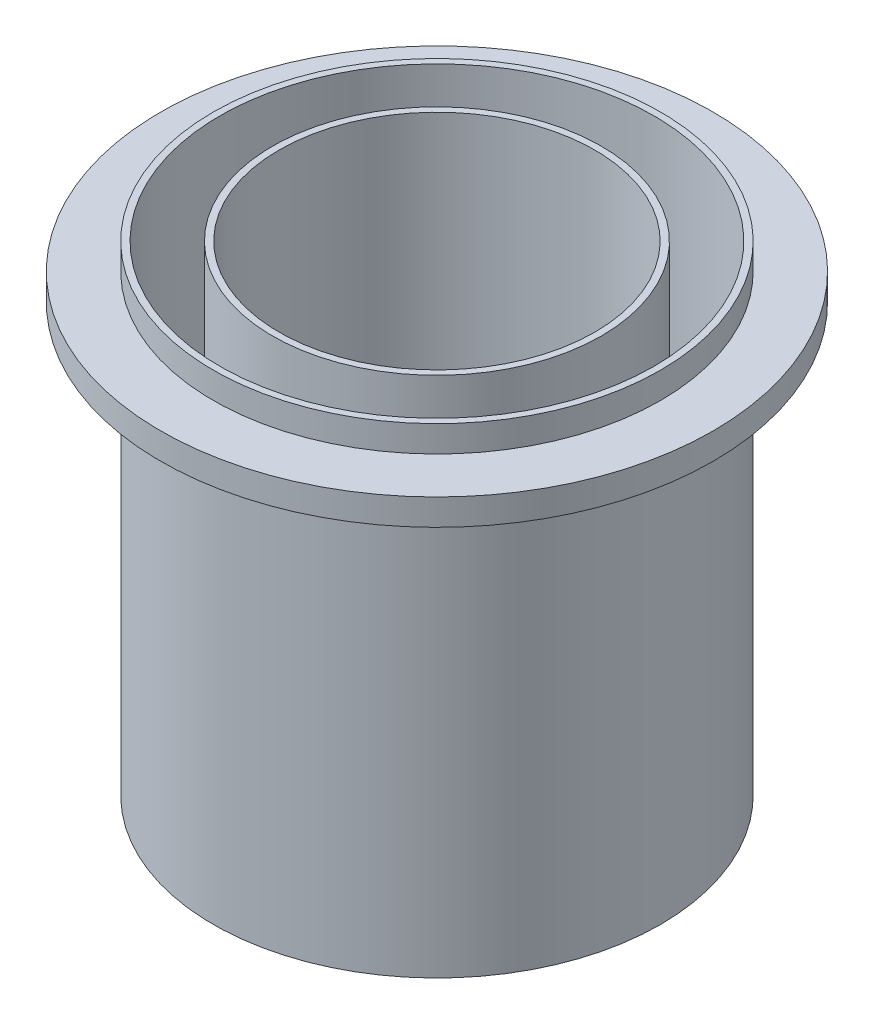
ISO-10303-21;
HEADER;
FILE_DESCRIPTION(('STEP AP214'),'2;1');
FILE_NAME('part.step','',(''),(''),'','','');
FILE_SCHEMA(('AUTOMOTIVE_DESIGN { 1 0 10303 214 1 1 1 1 }'));
ENDSEC;
DATA;
#1=APPLICATION_CONTEXT('core data for automotive mechanical design processes');
#2=APPLICATION_PROTOCOL_DEFINITION('international standard','automotive_design',2000,#1);
#3=PRODUCT_CONTEXT('',#1,'mechanical');
#4=PRODUCT('Part','Part','',(#3));
#5=PRODUCT_RELATED_PRODUCT_CATEGORY('part','',(#4));
#6=PRODUCT_DEFINITION_FORMATION('','',#4);
#7=PRODUCT_DEFINITION_CONTEXT('part definition',#1,'design');
#8=PRODUCT_DEFINITION('design','',#6,#7);
#9=PRODUCT_DEFINITION_SHAPE('','',#8);
#10=(LENGTH_UNIT() NAMED_UNIT(*) SI_UNIT(.MILLI.,.METRE.));
#11=(NAMED_UNIT(*) PLANE_ANGLE_UNIT() SI_UNIT($,.RADIAN.));
#12=(NAMED_UNIT(*) SI_UNIT($,.STERADIAN.) SOLID_ANGLE_UNIT());
#13=UNCERTAINTY_MEASURE_WITH_UNIT(LENGTH_MEASURE(1.E-05),#10,'distance_accuracy_value','');
#14=(GEOMETRIC_REPRESENTATION_CONTEXT(3) GLOBAL_UNCERTAINTY_ASSIGNED_CONTEXT((#13)) GLOBAL_UNIT_ASSIGNED_CONTEXT((#10,
#11,#12)) REPRESENTATION_CONTEXT('',''));
#15=CARTESIAN_POINT('',(0.,0.,0.));
#16=DIRECTION('',(0.,0.,1.));
#17=DIRECTION('',(1.,0.,0.));
#18=AXIS2_PLACEMENT_3D('',#15,#16,#17);
#19=CARTESIAN_POINT('',(0.,1.58749999999979,0.));
#20=DIRECTION('',(0.,1.,0.));
#21=DIRECTION('',(-1.,0.,0.));
#22=AXIS2_PLACEMENT_3D('',#19,#20,#21);
#23=PLANE('',#22);
#24=CARTESIAN_POINT('',(-16.4977839420935,1.58749999999973,-9.52500000000019));
#25=DIRECTION('',(0.,1.,0.));
#26=DIRECTION('',(-0.50000000000001,0.,0.866025403784433));
#27=AXIS2_PLACEMENT_3D('',#24,#25,#26);
#28=CIRCLE('',#27,3.175);
#29=CARTESIAN_POINT('',(-18.0852839420935,1.58749999999972,-6.77536934298462));
#30=VERTEX_POINT('',#29);
#31=EDGE_CURVE('E107',#30,#30,#28,.T.);
#32=ORIENTED_EDGE('',*,*,#31,.F.);
#33=EDGE_LOOP('',(#32));
#34=FACE_BOUND('',#33,.T.);
#35=CARTESIAN_POINT('',(-16.4977839420937,1.58749999999973,9.52499999999985));
#36=DIRECTION('',(0.,1.,0.));
#37=DIRECTION('',(0.499999999999992,0.,0.866025403784443));
#38=AXIS2_PLACEMENT_3D('',#35,#36,#37);
#39=CIRCLE('',#38,3.175);
#40=CARTESIAN_POINT('',(-14.9102839420937,1.58749999999973,12.2746306570155));
#41=VERTEX_POINT('',#40);
#42=EDGE_CURVE('E101',#41,#41,#39,.T.);
#43=ORIENTED_EDGE('',*,*,#42,.F.);
#44=EDGE_LOOP('',(#43));
#45=FACE_BOUND('',#44,.T.);
#46=CARTESIAN_POINT('',(0.,1.58749999999979,19.05));
#47=DIRECTION('',(0.,1.,0.));
#48=DIRECTION('',(1.,0.,0.));
#49=AXIS2_PLACEMENT_3D('',#46,#47,#48);
#50=CIRCLE('',#49,3.175);
#51=CARTESIAN_POINT('',(3.17499999999999,1.5874999999998,19.05));
#52=VERTEX_POINT('',#51);
#53=EDGE_CURVE('E95',#52,#52,#50,.T.);
#54=ORIENTED_EDGE('',*,*,#53,.F.);
#55=EDGE_LOOP('',(#54));
#56=FACE_BOUND('',#55,.T.);
#57=CARTESIAN_POINT('',(16.4977839420935,1.58749999999984,9.52500000000008));
#58=DIRECTION('',(0.,1.,0.));
#59=DIRECTION('',(0.500000000000004,0.,-0.866025403784436));
#60=AXIS2_PLACEMENT_3D('',#57,#58,#59);
#61=CIRCLE('',#60,3.175);
#62=CARTESIAN_POINT('',(18.0852839420935,1.58749999999985,6.77536934298449));
#63=VERTEX_POINT('',#62);
#64=EDGE_CURVE('E89',#63,#63,#61,.T.);
#65=ORIENTED_EDGE('',*,*,#64,.F.);
#66=EDGE_LOOP('',(#65));
#67=FACE_BOUND('',#66,.T.);
#68=CARTESIAN_POINT('',(16.4977839420936,1.58749999999984,-9.52499999999996));
#69=DIRECTION('',(0.,1.,0.));
#70=DIRECTION('',(-0.499999999999998,0.,-0.86602540378444));
#71=AXIS2_PLACEMENT_3D('',#68,#69,#70);
#72=CIRCLE('',#71,3.175);
#73=CARTESIAN_POINT('',(14.9102839420936,1.58749999999984,-12.2746306570156));
#74=VERTEX_POINT('',#73);
#75=EDGE_CURVE('E83',#74,#74,#72,.T.);
#76=ORIENTED_EDGE('',*,*,#75,.F.);
#77=EDGE_LOOP('',(#76));
#78=FACE_BOUND('',#77,.T.);
#79=CARTESIAN_POINT('',(0.,1.58749999999979,-19.05));
#80=DIRECTION('',(0.,1.,0.));
#81=DIRECTION('',(-1.,0.,0.));
#82=AXIS2_PLACEMENT_3D('',#79,#80,#81);
#83=CIRCLE('',#82,3.175);
#84=CARTESIAN_POINT('',(-3.17500000000001,1.58749999999978,-19.05));
#85=VERTEX_POINT('',#84);
#86=EDGE_CURVE('E77',#85,#85,#83,.T.);
#87=ORIENTED_EDGE('',*,*,#86,.F.);
#88=EDGE_LOOP('',(#87));
#89=FACE_BOUND('',#88,.T.);
#90=CARTESIAN_POINT('',(0.,1.58749999999985,0.));
#91=DIRECTION('',(0.,-1.,0.));
#92=DIRECTION('',(1.,0.,0.));
#93=AXIS2_PLACEMENT_3D('',#90,#91,#92);
#94=CIRCLE('',#93,38.1);
#95=CARTESIAN_POINT('',(38.1,1.58749999999999,0.));
#96=VERTEX_POINT('',#95);
#97=EDGE_CURVE('E10',#96,#96,#94,.T.);
#98=ORIENTED_EDGE('',*,*,#97,.F.);
#99=EDGE_LOOP('',(#98));
#100=FACE_BOUND('',#99,.T.);
#101=ADVANCED_FACE('F33',(#34,#45,#56,#67,#78,#89,#100),#23,.T.);
#102=CARTESIAN_POINT('',(1.93565135947845E-12,-554.392583441334,0.));
#103=DIRECTION('',(0.,-1.,0.));
#104=DIRECTION('',(1.,0.,0.));
#105=AXIS2_PLACEMENT_3D('',#102,#103,#104);
#106=CYLINDRICAL_SURFACE('',#105,38.1000000000002);
#107=ORIENTED_EDGE('',*,*,#97,.T.);
#108=EDGE_LOOP('',(#107));
#109=FACE_BOUND('',#108,.T.);
#110=CARTESIAN_POINT('',(-4.04619043655183E-13,115.8875,0.));
#111=DIRECTION('',(0.,-1.,0.));
#112=DIRECTION('',(1.,0.,0.));
#113=AXIS2_PLACEMENT_3D('',#110,#111,#112);
#114=CIRCLE('',#113,38.1000000000004);
#115=CARTESIAN_POINT('',(38.1,115.8875,0.));
#116=VERTEX_POINT('',#115);
#117=EDGE_CURVE('E39',#116,#116,#114,.T.);
#118=ORIENTED_EDGE('',*,*,#117,.F.);
#119=EDGE_LOOP('',(#118));
#120=FACE_BOUND('',#119,.T.);
#121=ADVANCED_FACE('F125',(#109,#120),#106,.F.);
#122=CARTESIAN_POINT('',(39.6875,115.8875,0.));
#123=DIRECTION('',(0.,1.,0.));
#124=DIRECTION('',(-1.,0.,0.));
#125=AXIS2_PLACEMENT_3D('',#122,#123,#124);
#126=PLANE('',#125);
#127=ORIENTED_EDGE('',*,*,#117,.T.);
#128=EDGE_LOOP('',(#127));
#129=FACE_BOUND('',#128,.T.);
#130=CARTESIAN_POINT('',(-4.04619043655183E-13,115.8875,0.));
#131=DIRECTION('',(0.,-1.,0.));
#132=DIRECTION('',(1.,0.,0.));
#133=AXIS2_PLACEMENT_3D('',#130,#131,#132);
#134=CIRCLE('',#133,39.6875000000004);
#135=CARTESIAN_POINT('',(39.6875,115.8875,0.));
#136=VERTEX_POINT('',#135);
#137=EDGE_CURVE('E43',#136,#136,#134,.T.);
#138=ORIENTED_EDGE('',*,*,#137,.F.);
#139=EDGE_LOOP('',(#138));
#140=FACE_BOUND('',#139,.T.);
#141=ADVANCED_FACE('F188',(#129,#140),#126,.T.);
#142=CARTESIAN_POINT('',(1.93565135947845E-12,-554.392583441334,0.));
#143=DIRECTION('',(0.,-1.,0.));
#144=DIRECTION('',(1.,0.,0.));
#145=AXIS2_PLACEMENT_3D('',#142,#143,#144);
#146=CYLINDRICAL_SURFACE('',#145,39.6875000000002);
#147=ORIENTED_EDGE('',*,*,#137,.T.);
#148=EDGE_LOOP('',(#147));
#149=FACE_BOUND('',#148,.T.);
#150=CARTESIAN_POINT('',(0.,1.58749999999985,0.));
#151=DIRECTION('',(0.,-1.,0.));
#152=DIRECTION('',(1.,0.,0.));
#153=AXIS2_PLACEMENT_3D('',#150,#151,#152);
#154=CIRCLE('',#153,39.6875);
#155=CARTESIAN_POINT('',(39.6875,1.58749999999999,0.));
#156=VERTEX_POINT('',#155);
#157=EDGE_CURVE('E47',#156,#156,#154,.T.);
#158=ORIENTED_EDGE('',*,*,#157,.F.);
#159=EDGE_LOOP('',(#158));
#160=FACE_BOUND('',#159,.T.);
#161=ADVANCED_FACE('F184',(#149,#160),#146,.T.);
#162=CARTESIAN_POINT('',(52.3875,1.58750000000002,0.));
#163=DIRECTION('',(0.,1.,0.));
#164=DIRECTION('',(-1.,0.,0.));
#165=AXIS2_PLACEMENT_3D('',#162,#163,#164);
#166=PLANE('',#165);
#167=ORIENTED_EDGE('',*,*,#157,.T.);
#168=EDGE_LOOP('',(#167));
#169=FACE_BOUND('',#168,.T.);
#170=CARTESIAN_POINT('',(0.,1.58749999999974,0.));
#171=DIRECTION('',(0.,-1.,0.));
#172=DIRECTION('',(1.,0.,0.));
#173=AXIS2_PLACEMENT_3D('',#170,#171,#172);
#174=CIRCLE('',#173,52.3875);
#175=CARTESIAN_POINT('',(52.3875,1.58749999999992,0.));
#176=VERTEX_POINT('',#175);
#177=EDGE_CURVE('E52',#176,#176,#174,.T.);
#178=ORIENTED_EDGE('',*,*,#177,.F.);
#179=EDGE_LOOP('',(#178));
#180=FACE_BOUND('',#179,.T.);
#181=ADVANCED_FACE('F180',(#169,#180),#166,.T.);
#182=CARTESIAN_POINT('',(1.93565135947845E-12,-554.392583441334,0.));
#183=DIRECTION('',(0.,-1.,0.));
#184=DIRECTION('',(1.,0.,0.));
#185=AXIS2_PLACEMENT_3D('',#182,#183,#184);
#186=CYLINDRICAL_SURFACE('',#185,52.3875000000002);
#187=ORIENTED_EDGE('',*,*,#177,.T.);
#188=EDGE_LOOP('',(#187));
#189=FACE_BOUND('',#188,.T.);
#190=CARTESIAN_POINT('',(-4.04619043655182E-13,115.8875,0.));
#191=DIRECTION('',(0.,-1.,0.));
#192=DIRECTION('',(1.,0.,0.));
#193=AXIS2_PLACEMENT_3D('',#190,#191,#192);
#194=CIRCLE('',#193,52.3875000000004);
#195=CARTESIAN_POINT('',(52.3875,115.8875,0.));
#196=VERTEX_POINT('',#195);
#197=EDGE_CURVE('E55',#196,#196,#194,.T.);
#198=ORIENTED_EDGE('',*,*,#197,.F.);
#199=EDGE_LOOP('',(#198));
#200=FACE_BOUND('',#199,.T.);
#201=ADVANCED_FACE('F176',(#189,#200),#186,.F.);
#202=CARTESIAN_POINT('',(53.975,115.8875,0.));
#203=DIRECTION('',(0.,1.,0.));
#204=DIRECTION('',(-1.,0.,0.));
#205=AXIS2_PLACEMENT_3D('',#202,#203,#204);
#206=PLANE('',#205);
#207=ORIENTED_EDGE('',*,*,#197,.T.);
#208=EDGE_LOOP('',(#207));
#209=FACE_BOUND('',#208,.T.);
#210=CARTESIAN_POINT('',(-4.04619043655182E-13,115.8875,0.));
#211=DIRECTION('',(0.,-1.,0.));
#212=DIRECTION('',(1.,0.,0.));
#213=AXIS2_PLACEMENT_3D('',#210,#211,#212);
#214=CIRCLE('',#213,53.9750000000004);
#215=CARTESIAN_POINT('',(53.975,115.8875,0.));
#216=VERTEX_POINT('',#215);
#217=EDGE_CURVE('E58',#216,#216,#214,.T.);
#218=ORIENTED_EDGE('',*,*,#217,.F.);
#219=EDGE_LOOP('',(#218));
#220=FACE_BOUND('',#219,.T.);
#221=ADVANCED_FACE('F172',(#209,#220),#206,.T.);
#222=CARTESIAN_POINT('',(1.93565135947845E-12,-554.392583441334,0.));
#223=DIRECTION('',(0.,-1.,0.));
#224=DIRECTION('',(1.,0.,0.));
#225=AXIS2_PLACEMENT_3D('',#222,#223,#224);
#226=CYLINDRICAL_SURFACE('',#225,53.9750000000004);
#227=ORIENTED_EDGE('',*,*,#217,.T.);
#228=EDGE_LOOP('',(#227));
#229=FACE_BOUND('',#228,.T.);
#230=CARTESIAN_POINT('',(-3.82448137153528E-13,109.5375,0.));
#231=DIRECTION('',(0.,-1.,0.));
#232=DIRECTION('',(1.,0.,0.));
#233=AXIS2_PLACEMENT_3D('',#230,#231,#232);
#234=CIRCLE('',#233,53.9750000000004);
#235=CARTESIAN_POINT('',(53.975,109.5375,0.));
#236=VERTEX_POINT('',#235);
#237=EDGE_CURVE('E61',#236,#236,#234,.T.);
#238=ORIENTED_EDGE('',*,*,#237,.F.);
#239=EDGE_LOOP('',(#238));
#240=FACE_BOUND('',#239,.T.);
#241=ADVANCED_FACE('F168',(#229,#240),#226,.T.);
#242=CARTESIAN_POINT('',(53.975,109.5375,0.));
#243=DIRECTION('',(0.,1.,0.));
#244=DIRECTION('',(-1.,0.,0.));
#245=AXIS2_PLACEMENT_3D('',#242,#243,#244);
#246=PLANE('',#245);
#247=ORIENTED_EDGE('',*,*,#237,.T.);
#248=EDGE_LOOP('',(#247));
#249=FACE_BOUND('',#248,.T.);
#250=CARTESIAN_POINT('',(-3.82448137153528E-13,109.5375,0.));
#251=DIRECTION('',(0.,-1.,0.));
#252=DIRECTION('',(1.,0.,0.));
#253=AXIS2_PLACEMENT_3D('',#250,#251,#252);
#254=CIRCLE('',#253,66.6750000000004);
#255=CARTESIAN_POINT('',(66.675,109.5375,0.));
#256=VERTEX_POINT('',#255);
#257=EDGE_CURVE('E64',#256,#256,#254,.T.);
#258=ORIENTED_EDGE('',*,*,#257,.F.);
#259=EDGE_LOOP('',(#258));
#260=FACE_BOUND('',#259,.T.);
#261=ADVANCED_FACE('F164',(#249,#260),#246,.T.);
#262=CARTESIAN_POINT('',(1.93565135947845E-12,-554.392583441334,0.));
#263=DIRECTION('',(0.,-1.,0.));
#264=DIRECTION('',(1.,0.,0.));
#265=AXIS2_PLACEMENT_3D('',#262,#263,#264);
#266=CYLINDRICAL_SURFACE('',#265,66.6750000000004);
#267=ORIENTED_EDGE('',*,*,#257,.T.);
#268=EDGE_LOOP('',(#267));
#269=FACE_BOUND('',#268,.T.);
#270=CARTESIAN_POINT('',(-3.60277230651875E-13,103.1875,0.));
#271=DIRECTION('',(0.,-1.,0.));
#272=DIRECTION('',(1.,0.,0.));
#273=AXIS2_PLACEMENT_3D('',#270,#271,#272);
#274=CIRCLE('',#273,66.6750000000004);
#275=CARTESIAN_POINT('',(66.675,103.1875,0.));
#276=VERTEX_POINT('',#275);
#277=EDGE_CURVE('E67',#276,#276,#274,.T.);
#278=ORIENTED_EDGE('',*,*,#277,.F.);
#279=EDGE_LOOP('',(#278));
#280=FACE_BOUND('',#279,.T.);
#281=ADVANCED_FACE('F160',(#269,#280),#266,.T.);
#282=CARTESIAN_POINT('',(53.975,103.1875,0.));
#283=DIRECTION('',(0.,-1.,0.));
#284=DIRECTION('',(1.,0.,0.));
#285=AXIS2_PLACEMENT_3D('',#282,#283,#284);
#286=PLANE('',#285);
#287=ORIENTED_EDGE('',*,*,#277,.T.);
#288=EDGE_LOOP('',(#287));
#289=FACE_BOUND('',#288,.T.);
#290=CARTESIAN_POINT('',(-3.60277230651875E-13,103.1875,0.));
#291=DIRECTION('',(0.,-1.,0.));
#292=DIRECTION('',(1.,0.,0.));
#293=AXIS2_PLACEMENT_3D('',#290,#291,#292);
#294=CIRCLE('',#293,53.9750000000004);
#295=CARTESIAN_POINT('',(53.975,103.1875,0.));
#296=VERTEX_POINT('',#295);
#297=EDGE_CURVE('E70',#296,#296,#294,.T.);
#298=ORIENTED_EDGE('',*,*,#297,.F.);
#299=EDGE_LOOP('',(#298));
#300=FACE_BOUND('',#299,.T.);
#301=ADVANCED_FACE('F156',(#289,#300),#286,.T.);
#302=CARTESIAN_POINT('',(1.93565135947845E-12,-554.392583441334,0.));
#303=DIRECTION('',(0.,-1.,0.));
#304=DIRECTION('',(1.,0.,0.));
#305=AXIS2_PLACEMENT_3D('',#302,#303,#304);
#306=CYLINDRICAL_SURFACE('',#305,53.9750000000002);
#307=ORIENTED_EDGE('',*,*,#297,.T.);
#308=EDGE_LOOP('',(#307));
#309=FACE_BOUND('',#308,.T.);
#310=CARTESIAN_POINT('',(0.,-2.22044604925031E-13,0.));
#311=DIRECTION('',(0.,-1.,0.));
#312=DIRECTION('',(1.,0.,0.));
#313=AXIS2_PLACEMENT_3D('',#310,#311,#312);
#314=CIRCLE('',#313,53.975);
#315=CARTESIAN_POINT('',(53.975,0.,0.));
#316=VERTEX_POINT('',#315);
#317=EDGE_CURVE('E73',#316,#316,#314,.T.);
#318=ORIENTED_EDGE('',*,*,#317,.F.);
#319=EDGE_LOOP('',(#318));
#320=FACE_BOUND('',#319,.T.);
#321=ADVANCED_FACE('F149',(#309,#320),#306,.T.);
#322=CARTESIAN_POINT('',(53.975,0.,0.));
#323=DIRECTION('',(0.,-1.,0.));
#324=DIRECTION('',(1.,0.,0.));
#325=AXIS2_PLACEMENT_3D('',#322,#323,#324);
#326=PLANE('',#325);
#327=CARTESIAN_POINT('',(-16.4977839420934,-5.33861149731862E-13,-9.52500000000019));
#328=DIRECTION('',(0.,1.,0.));
#329=DIRECTION('',(-0.50000000000001,0.,0.866025403784433));
#330=AXIS2_PLACEMENT_3D('',#327,#328,#329);
#331=CIRCLE('',#330,3.175);
#332=CARTESIAN_POINT('',(-18.0852839420935,-5.39403876357276E-13,-6.77536934298462));
#333=VERTEX_POINT('',#332);
#334=EDGE_CURVE('E104',#333,#333,#331,.T.);
#335=ORIENTED_EDGE('',*,*,#334,.T.);
#336=EDGE_LOOP('',(#335));
#337=FACE_BOUND('',#336,.T.);
#338=CARTESIAN_POINT('',(-16.4977839420936,-5.34077990166359E-13,9.52499999999985));
#339=DIRECTION('',(0.,1.,0.));
#340=DIRECTION('',(0.499999999999992,0.,0.866025403784443));
#341=AXIS2_PLACEMENT_3D('',#338,#339,#340);
#342=CIRCLE('',#341,3.175);
#343=CARTESIAN_POINT('',(-14.9102839420937,-5.28535263540946E-13,12.2746306570155));
#344=VERTEX_POINT('',#343);
#345=EDGE_CURVE('E98',#344,#344,#342,.T.);
#346=ORIENTED_EDGE('',*,*,#345,.T.);
#347=EDGE_LOOP('',(#346));
#348=FACE_BOUND('',#347,.T.);
#349=CARTESIAN_POINT('',(0.,-4.76181594155634E-13,19.05));
#350=DIRECTION('',(0.,1.,0.));
#351=DIRECTION('',(1.,0.,0.));
#352=AXIS2_PLACEMENT_3D('',#349,#350,#351);
#353=CIRCLE('',#352,3.175);
#354=CARTESIAN_POINT('',(3.175,-4.65096140904807E-13,19.05));
#355=VERTEX_POINT('',#354);
#356=EDGE_CURVE('E92',#355,#355,#353,.T.);
#357=ORIENTED_EDGE('',*,*,#356,.T.);
#358=EDGE_LOOP('',(#357));
#359=FACE_BOUND('',#358,.T.);
#360=CARTESIAN_POINT('',(16.4977839420935,-4.18718879013902E-13,9.52500000000008));
#361=DIRECTION('',(0.,1.,0.));
#362=DIRECTION('',(0.500000000000004,0.,-0.866025403784436));
#363=AXIS2_PLACEMENT_3D('',#360,#361,#362);
#364=CIRCLE('',#363,3.175);
#365=CARTESIAN_POINT('',(18.0852839420935,-4.13176152388488E-13,6.77536934298449));
#366=VERTEX_POINT('',#365);
#367=EDGE_CURVE('E86',#366,#366,#364,.T.);
#368=ORIENTED_EDGE('',*,*,#367,.T.);
#369=EDGE_LOOP('',(#368));
#370=FACE_BOUND('',#369,.T.);
#371=CARTESIAN_POINT('',(16.4977839420936,-4.18502038579405E-13,-9.52499999999996));
#372=DIRECTION('',(0.,1.,0.));
#373=DIRECTION('',(-0.499999999999998,0.,-0.86602540378444));
#374=AXIS2_PLACEMENT_3D('',#371,#372,#373);
#375=CIRCLE('',#374,3.175);
#376=CARTESIAN_POINT('',(14.9102839420936,-4.24044765204818E-13,-12.2746306570156));
#377=VERTEX_POINT('',#376);
#378=EDGE_CURVE('E80',#377,#377,#375,.T.);
#379=ORIENTED_EDGE('',*,*,#378,.T.);
#380=EDGE_LOOP('',(#379));
#381=FACE_BOUND('',#380,.T.);
#382=CARTESIAN_POINT('',(0.,-2.32452945780892E-13,-19.05));
#383=DIRECTION('',(0.,1.,0.));
#384=DIRECTION('',(-1.,0.,0.));
#385=AXIS2_PLACEMENT_3D('',#382,#383,#384);
#386=CIRCLE('',#385,3.175);
#387=CARTESIAN_POINT('',(-3.175,-2.43538399031719E-13,-19.05));
#388=VERTEX_POINT('',#387);
#389=EDGE_CURVE('E76',#388,#388,#386,.T.);
#390=ORIENTED_EDGE('',*,*,#389,.T.);
#391=EDGE_LOOP('',(#390));
#392=FACE_BOUND('',#391,.T.);
#393=ORIENTED_EDGE('',*,*,#317,.T.);
#394=EDGE_LOOP('',(#393));
#395=FACE_BOUND('',#394,.T.);
#396=ADVANCED_FACE('F113',(#337,#348,#359,#370,#381,#392,#395),#326,.T.);
#397=CARTESIAN_POINT('',(0.,-2.32452945780892E-13,-19.05));
#398=DIRECTION('',(0.,1.,0.));
#399=DIRECTION('',(-1.,0.,0.));
#400=AXIS2_PLACEMENT_3D('',#397,#398,#399);
#401=CYLINDRICAL_SURFACE('',#400,3.175);
#402=ORIENTED_EDGE('',*,*,#389,.F.);
#403=EDGE_LOOP('',(#402));
#404=FACE_BOUND('',#403,.T.);
#405=ORIENTED_EDGE('',*,*,#86,.T.);
#406=EDGE_LOOP('',(#405));
#407=FACE_BOUND('',#406,.T.);
#408=ADVANCED_FACE('F137',(#404,#407),#401,.F.);
#409=CARTESIAN_POINT('',(16.4977839420936,-4.18502038579405E-13,-9.52499999999996));
#410=DIRECTION('',(0.,1.,0.));
#411=DIRECTION('',(-1.,0.,0.));
#412=AXIS2_PLACEMENT_3D('',#409,#410,#411);
#413=CYLINDRICAL_SURFACE('',#412,3.175);
#414=ORIENTED_EDGE('',*,*,#378,.F.);
#415=EDGE_LOOP('',(#414));
#416=FACE_BOUND('',#415,.T.);
#417=ORIENTED_EDGE('',*,*,#75,.T.);
#418=EDGE_LOOP('',(#417));
#419=FACE_BOUND('',#418,.T.);
#420=ADVANCED_FACE('F139',(#416,#419),#413,.F.);
#421=CARTESIAN_POINT('',(16.4977839420935,-4.18718879013902E-13,9.52500000000008));
#422=DIRECTION('',(0.,1.,0.));
#423=DIRECTION('',(-1.,0.,0.));
#424=AXIS2_PLACEMENT_3D('',#421,#422,#423);
#425=CYLINDRICAL_SURFACE('',#424,3.175);
#426=ORIENTED_EDGE('',*,*,#367,.F.);
#427=EDGE_LOOP('',(#426));
#428=FACE_BOUND('',#427,.T.);
#429=ORIENTED_EDGE('',*,*,#64,.T.);
#430=EDGE_LOOP('',(#429));
#431=FACE_BOUND('',#430,.T.);
#432=ADVANCED_FACE('F146',(#428,#431),#425,.F.);
#433=CARTESIAN_POINT('',(0.,-4.76181594155634E-13,19.05));
#434=DIRECTION('',(0.,1.,0.));
#435=DIRECTION('',(-1.,0.,0.));
#436=AXIS2_PLACEMENT_3D('',#433,#434,#435);
#437=CYLINDRICAL_SURFACE('',#436,3.175);
#438=ORIENTED_EDGE('',*,*,#356,.F.);
#439=EDGE_LOOP('',(#438));
#440=FACE_BOUND('',#439,.T.);
#441=ORIENTED_EDGE('',*,*,#53,.T.);
#442=EDGE_LOOP('',(#441));
#443=FACE_BOUND('',#442,.T.);
#444=ADVANCED_FACE('F260',(#440,#443),#437,.F.);
#445=CARTESIAN_POINT('',(-16.4977839420936,-5.34077990166359E-13,9.52499999999985));
#446=DIRECTION('',(0.,1.,0.));
#447=DIRECTION('',(-1.,0.,0.));
#448=AXIS2_PLACEMENT_3D('',#445,#446,#447);
#449=CYLINDRICAL_SURFACE('',#448,3.175);
#450=ORIENTED_EDGE('',*,*,#345,.F.);
#451=EDGE_LOOP('',(#450));
#452=FACE_BOUND('',#451,.T.);
#453=ORIENTED_EDGE('',*,*,#42,.T.);
#454=EDGE_LOOP('',(#453));
#455=FACE_BOUND('',#454,.T.);
#456=ADVANCED_FACE('F119',(#452,#455),#449,.F.);
#457=CARTESIAN_POINT('',(-16.4977839420934,-5.33861149731862E-13,-9.52500000000019));
#458=DIRECTION('',(0.,1.,0.));
#459=DIRECTION('',(-1.,0.,0.));
#460=AXIS2_PLACEMENT_3D('',#457,#458,#459);
#461=CYLINDRICAL_SURFACE('',#460,3.175);
#462=ORIENTED_EDGE('',*,*,#334,.F.);
#463=EDGE_LOOP('',(#462));
#464=FACE_BOUND('',#463,.T.);
#465=ORIENTED_EDGE('',*,*,#31,.T.);
#466=EDGE_LOOP('',(#465));
#467=FACE_BOUND('',#466,.T.);
#468=ADVANCED_FACE('F116',(#464,#467),#461,.F.);
#469=CLOSED_SHELL('',(#101,#121,#141,#161,#181,#201,#221,#241,#261,#281,#301,#321,#396,#408,
#420,#432,#444,#456,#468));
#470=MANIFOLD_SOLID_BREP('B2',#469);
#471=ADVANCED_BREP_SHAPE_REPRESENTATION('',(#18,#470),#14);
#472=SHAPE_DEFINITION_REPRESENTATION(#9,#471);
ENDSEC;
END-ISO-10303-21;
